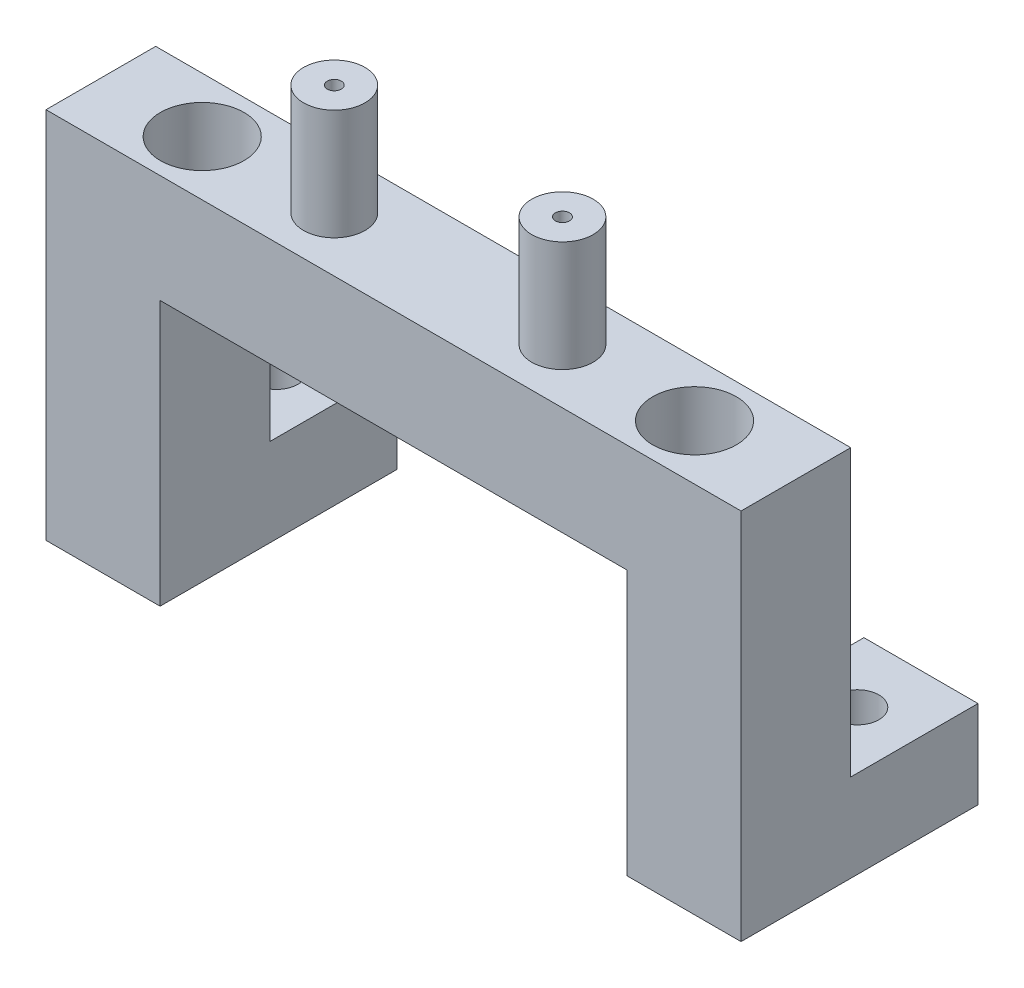
ISO-10303-21;
HEADER;
FILE_DESCRIPTION(('STEP AP214'),'2;1');
FILE_NAME('part.step','',(''),(''),'','','');
FILE_SCHEMA(('AUTOMOTIVE_DESIGN { 1 0 10303 214 1 1 1 1 }'));
ENDSEC;
DATA;
#1=APPLICATION_CONTEXT('core data for automotive mechanical design processes');
#2=APPLICATION_PROTOCOL_DEFINITION('international standard','automotive_design',2000,#1);
#3=PRODUCT_CONTEXT('',#1,'mechanical');
#4=PRODUCT('Part','Part','',(#3));
#5=PRODUCT_RELATED_PRODUCT_CATEGORY('part','',(#4));
#6=PRODUCT_DEFINITION_FORMATION('','',#4);
#7=PRODUCT_DEFINITION_CONTEXT('part definition',#1,'design');
#8=PRODUCT_DEFINITION('design','',#6,#7);
#9=PRODUCT_DEFINITION_SHAPE('','',#8);
#10=(LENGTH_UNIT() NAMED_UNIT(*) SI_UNIT(.MILLI.,.METRE.));
#11=(NAMED_UNIT(*) PLANE_ANGLE_UNIT() SI_UNIT($,.RADIAN.));
#12=(NAMED_UNIT(*) SI_UNIT($,.STERADIAN.) SOLID_ANGLE_UNIT());
#13=UNCERTAINTY_MEASURE_WITH_UNIT(LENGTH_MEASURE(1.E-05),#10,'distance_accuracy_value','');
#14=(GEOMETRIC_REPRESENTATION_CONTEXT(3) GLOBAL_UNCERTAINTY_ASSIGNED_CONTEXT((#13)) GLOBAL_UNIT_ASSIGNED_CONTEXT((#10,
#11,#12)) REPRESENTATION_CONTEXT('',''));
#15=CARTESIAN_POINT('',(0.,0.,0.));
#16=DIRECTION('',(0.,0.,1.));
#17=DIRECTION('',(1.,0.,0.));
#18=AXIS2_PLACEMENT_3D('',#15,#16,#17);
#19=CARTESIAN_POINT('',(0.,0.,0.));
#20=DIRECTION('',(0.,0.,1.));
#21=DIRECTION('',(1.,0.,0.));
#22=AXIS2_PLACEMENT_3D('',#19,#20,#21);
#23=PLANE('',#22);
#24=DIRECTION('',(1.,0.,0.));
#25=VECTOR('',#24,1.);
#26=CARTESIAN_POINT('',(-54.693316182238,-13.3702269343777,0.));
#27=LINE('',#26,#25);
#28=CARTESIAN_POINT('',(-54.693316182238,-13.3702269343777,0.));
#29=VERTEX_POINT('',#28);
#30=CARTESIAN_POINT('',(-41.693316182238,-13.3702269343777,0.));
#31=VERTEX_POINT('',#30);
#32=EDGE_CURVE('E66',#29,#31,#27,.T.);
#33=ORIENTED_EDGE('',*,*,#32,.F.);
#34=DIRECTION('',(0.,1.,0.));
#35=VECTOR('',#34,1.);
#36=CARTESIAN_POINT('',(-54.693316182238,-23.3702269343778,0.));
#37=LINE('',#36,#35);
#38=CARTESIAN_POINT('',(-54.693316182238,19.1297730656223,0.));
#39=VERTEX_POINT('',#38);
#40=EDGE_CURVE('E330',#29,#39,#37,.T.);
#41=ORIENTED_EDGE('',*,*,#40,.T.);
#42=DIRECTION('',(1.,0.,0.));
#43=VECTOR('',#42,1.);
#44=CARTESIAN_POINT('',(-54.693316182238,19.1297730656223,0.));
#45=LINE('',#44,#43);
#46=CARTESIAN_POINT('',(24.506683817762,19.1297730656223,0.));
#47=VERTEX_POINT('',#46);
#48=EDGE_CURVE('E327',#39,#47,#45,.T.);
#49=ORIENTED_EDGE('',*,*,#48,.T.);
#50=DIRECTION('',(0.,1.,0.));
#51=VECTOR('',#50,1.);
#52=CARTESIAN_POINT('',(24.506683817762,-23.3702269343778,0.));
#53=LINE('',#52,#51);
#54=CARTESIAN_POINT('',(24.506683817762,-13.3702269343777,0.));
#55=VERTEX_POINT('',#54);
#56=EDGE_CURVE('E249',#55,#47,#53,.T.);
#57=ORIENTED_EDGE('',*,*,#56,.F.);
#58=DIRECTION('',(-1.,0.,0.));
#59=VECTOR('',#58,1.);
#60=CARTESIAN_POINT('',(24.506683817762,-13.3702269343777,0.));
#61=LINE('',#60,#59);
#62=CARTESIAN_POINT('',(11.506683817762,-13.3702269343777,0.));
#63=VERTEX_POINT('',#62);
#64=EDGE_CURVE('E224',#55,#63,#61,.T.);
#65=ORIENTED_EDGE('',*,*,#64,.T.);
#66=DIRECTION('',(0.,1.,0.));
#67=VECTOR('',#66,1.);
#68=CARTESIAN_POINT('',(11.506683817762,-23.3702269343778,0.));
#69=LINE('',#68,#67);
#70=CARTESIAN_POINT('',(11.506683817762,6.80386050632364,0.));
#71=VERTEX_POINT('',#70);
#72=EDGE_CURVE('E255',#63,#71,#69,.T.);
#73=ORIENTED_EDGE('',*,*,#72,.T.);
#74=DIRECTION('',(1.,0.,0.));
#75=VECTOR('',#74,1.);
#76=CARTESIAN_POINT('',(-41.693316182238,6.80386050632364,0.));
#77=LINE('',#76,#75);
#78=CARTESIAN_POINT('',(-41.693316182238,6.80386050632364,0.));
#79=VERTEX_POINT('',#78);
#80=EDGE_CURVE('E308',#79,#71,#77,.T.);
#81=ORIENTED_EDGE('',*,*,#80,.F.);
#82=DIRECTION('',(0.,1.,0.));
#83=VECTOR('',#82,1.);
#84=CARTESIAN_POINT('',(-41.693316182238,-23.3702269343778,0.));
#85=LINE('',#84,#83);
#86=EDGE_CURVE('E88',#31,#79,#85,.T.);
#87=ORIENTED_EDGE('',*,*,#86,.F.);
#88=EDGE_LOOP('',(#33,#41,#49,#57,#65,#73,#81,#87));
#89=FACE_BOUND('',#88,.T.);
#90=ADVANCED_FACE('F50',(#89),#23,.F.);
#91=CARTESIAN_POINT('',(-41.693316182238,6.80386050632364,12.5));
#92=DIRECTION('',(0.,1.,0.));
#93=DIRECTION('',(0.,0.,1.));
#94=AXIS2_PLACEMENT_3D('',#91,#92,#93);
#95=PLANE('',#94);
#96=CARTESIAN_POINT('',(-28.093316182238,6.80386050632364,6.25000000000001));
#97=DIRECTION('',(0.,1.,0.));
#98=DIRECTION('',(0.,0.,1.));
#99=AXIS2_PLACEMENT_3D('',#96,#97,#98);
#100=CIRCLE('',#99,0.799999999999999);
#101=CARTESIAN_POINT('',(-28.093316182238,6.80386050632364,7.05000000000001));
#102=VERTEX_POINT('',#101);
#103=EDGE_CURVE('E180',#102,#102,#100,.T.);
#104=ORIENTED_EDGE('',*,*,#103,.T.);
#105=EDGE_LOOP('',(#104));
#106=FACE_BOUND('',#105,.T.);
#107=CARTESIAN_POINT('',(-2.09331618223797,6.80386050632364,6.25000000000001));
#108=DIRECTION('',(0.,1.,0.));
#109=DIRECTION('',(0.,0.,1.));
#110=AXIS2_PLACEMENT_3D('',#107,#108,#109);
#111=CIRCLE('',#110,0.8);
#112=CARTESIAN_POINT('',(-2.09331618223797,6.80386050632364,7.05000000000001));
#113=VERTEX_POINT('',#112);
#114=EDGE_CURVE('E188',#113,#113,#111,.T.);
#115=ORIENTED_EDGE('',*,*,#114,.T.);
#116=EDGE_LOOP('',(#115));
#117=FACE_BOUND('',#116,.T.);
#118=ORIENTED_EDGE('',*,*,#80,.T.);
#119=DIRECTION('',(0.,0.,-1.));
#120=VECTOR('',#119,1.);
#121=CARTESIAN_POINT('',(11.506683817762,6.80386050632364,12.5));
#122=LINE('',#121,#120);
#123=CARTESIAN_POINT('',(11.506683817762,6.80386050632364,12.5));
#124=VERTEX_POINT('',#123);
#125=EDGE_CURVE('E263',#124,#71,#122,.T.);
#126=ORIENTED_EDGE('',*,*,#125,.F.);
#127=DIRECTION('',(1.,0.,0.));
#128=VECTOR('',#127,1.);
#129=CARTESIAN_POINT('',(-41.693316182238,6.80386050632364,12.5));
#130=LINE('',#129,#128);
#131=CARTESIAN_POINT('',(-41.693316182238,6.80386050632364,12.5));
#132=VERTEX_POINT('',#131);
#133=EDGE_CURVE('E309',#132,#124,#130,.T.);
#134=ORIENTED_EDGE('',*,*,#133,.F.);
#135=DIRECTION('',(0.,0.,-1.));
#136=VECTOR('',#135,1.);
#137=CARTESIAN_POINT('',(-41.693316182238,6.80386050632364,12.5));
#138=LINE('',#137,#136);
#139=EDGE_CURVE('E324',#132,#79,#138,.T.);
#140=ORIENTED_EDGE('',*,*,#139,.T.);
#141=EDGE_LOOP('',(#118,#126,#134,#140));
#142=FACE_BOUND('',#141,.T.);
#143=ADVANCED_FACE('F52',(#106,#117,#142),#95,.F.);
#144=CARTESIAN_POINT('',(-54.693316182238,19.1297730656223,12.5));
#145=DIRECTION('',(0.,1.,0.));
#146=DIRECTION('',(0.,0.,1.));
#147=AXIS2_PLACEMENT_3D('',#144,#145,#146);
#148=PLANE('',#147);
#149=CARTESIAN_POINT('',(-43.143316182238,19.1297730656223,6.24999999999999));
#150=DIRECTION('',(0.,1.,0.));
#151=DIRECTION('',(0.,0.,1.));
#152=AXIS2_PLACEMENT_3D('',#149,#150,#151);
#153=CIRCLE('',#152,4.7625);
#154=CARTESIAN_POINT('',(-43.143316182238,19.1297730656223,11.0125));
#155=VERTEX_POINT('',#154);
#156=EDGE_CURVE('E163',#155,#155,#153,.T.);
#157=ORIENTED_EDGE('',*,*,#156,.F.);
#158=EDGE_LOOP('',(#157));
#159=FACE_BOUND('',#158,.T.);
#160=CARTESIAN_POINT('',(12.956683817762,19.1297730656223,6.25000000000001));
#161=DIRECTION('',(0.,1.,0.));
#162=DIRECTION('',(0.,0.,1.));
#163=AXIS2_PLACEMENT_3D('',#160,#161,#162);
#164=CIRCLE('',#163,4.7625);
#165=CARTESIAN_POINT('',(12.956683817762,19.1297730656223,11.0125));
#166=VERTEX_POINT('',#165);
#167=EDGE_CURVE('E162',#166,#166,#164,.T.);
#168=ORIENTED_EDGE('',*,*,#167,.F.);
#169=EDGE_LOOP('',(#168));
#170=FACE_BOUND('',#169,.T.);
#171=CARTESIAN_POINT('',(-2.09331618223797,19.1297730656223,6.25000000000001));
#172=DIRECTION('',(0.,1.,0.));
#173=DIRECTION('',(0.,0.,1.));
#174=AXIS2_PLACEMENT_3D('',#171,#172,#173);
#175=CIRCLE('',#174,3.5);
#176=CARTESIAN_POINT('',(-2.09331618223797,19.1297730656223,9.75000000000001));
#177=VERTEX_POINT('',#176);
#178=EDGE_CURVE('E193',#177,#177,#175,.T.);
#179=ORIENTED_EDGE('',*,*,#178,.F.);
#180=EDGE_LOOP('',(#179));
#181=FACE_BOUND('',#180,.T.);
#182=CARTESIAN_POINT('',(-28.093316182238,19.1297730656223,6.25000000000001));
#183=DIRECTION('',(0.,1.,0.));
#184=DIRECTION('',(0.,0.,1.));
#185=AXIS2_PLACEMENT_3D('',#182,#183,#184);
#186=CIRCLE('',#185,3.5);
#187=CARTESIAN_POINT('',(-28.093316182238,19.1297730656223,9.75000000000001));
#188=VERTEX_POINT('',#187);
#189=EDGE_CURVE('E197',#188,#188,#186,.T.);
#190=ORIENTED_EDGE('',*,*,#189,.F.);
#191=EDGE_LOOP('',(#190));
#192=FACE_BOUND('',#191,.T.);
#193=ORIENTED_EDGE('',*,*,#48,.F.);
#194=DIRECTION('',(0.,0.,-1.));
#195=VECTOR('',#194,1.);
#196=CARTESIAN_POINT('',(-54.693316182238,19.1297730656223,12.5));
#197=LINE('',#196,#195);
#198=CARTESIAN_POINT('',(-54.693316182238,19.1297730656223,12.5));
#199=VERTEX_POINT('',#198);
#200=EDGE_CURVE('E12',#199,#39,#197,.T.);
#201=ORIENTED_EDGE('',*,*,#200,.F.);
#202=DIRECTION('',(1.,0.,0.));
#203=VECTOR('',#202,1.);
#204=CARTESIAN_POINT('',(-54.693316182238,19.1297730656223,12.5));
#205=LINE('',#204,#203);
#206=CARTESIAN_POINT('',(24.506683817762,19.1297730656223,12.5));
#207=VERTEX_POINT('',#206);
#208=EDGE_CURVE('E312',#199,#207,#205,.T.);
#209=ORIENTED_EDGE('',*,*,#208,.T.);
#210=DIRECTION('',(0.,0.,-1.));
#211=VECTOR('',#210,1.);
#212=CARTESIAN_POINT('',(24.506683817762,19.1297730656223,12.5));
#213=LINE('',#212,#211);
#214=EDGE_CURVE('E281',#207,#47,#213,.T.);
#215=ORIENTED_EDGE('',*,*,#214,.T.);
#216=EDGE_LOOP('',(#193,#201,#209,#215));
#217=FACE_BOUND('',#216,.T.);
#218=ADVANCED_FACE('F374',(#159,#170,#181,#192,#217),#148,.T.);
#219=CARTESIAN_POINT('',(-54.693316182238,-23.3702269343778,12.5));
#220=DIRECTION('',(-1.,0.,0.));
#221=DIRECTION('',(0.,0.,1.));
#222=AXIS2_PLACEMENT_3D('',#219,#220,#221);
#223=PLANE('',#222);
#224=ORIENTED_EDGE('',*,*,#40,.F.);
#225=DIRECTION('',(0.,0.,1.));
#226=VECTOR('',#225,1.);
#227=CARTESIAN_POINT('',(-54.693316182238,-13.3702269343777,-14.5));
#228=LINE('',#227,#226);
#229=CARTESIAN_POINT('',(-54.693316182238,-13.3702269343777,-14.5));
#230=VERTEX_POINT('',#229);
#231=EDGE_CURVE('E299',#230,#29,#228,.T.);
#232=ORIENTED_EDGE('',*,*,#231,.F.);
#233=DIRECTION('',(0.,1.,0.));
#234=VECTOR('',#233,1.);
#235=CARTESIAN_POINT('',(-54.693316182238,-23.3702269343778,-14.5));
#236=LINE('',#235,#234);
#237=CARTESIAN_POINT('',(-54.693316182238,-23.3702269343778,-14.5));
#238=VERTEX_POINT('',#237);
#239=EDGE_CURVE('E296',#238,#230,#236,.T.);
#240=ORIENTED_EDGE('',*,*,#239,.F.);
#241=DIRECTION('',(0.,0.,-1.));
#242=VECTOR('',#241,1.);
#243=CARTESIAN_POINT('',(-54.693316182238,-23.3702269343778,12.5));
#244=LINE('',#243,#242);
#245=CARTESIAN_POINT('',(-54.693316182238,-23.3702269343778,12.5));
#246=VERTEX_POINT('',#245);
#247=EDGE_CURVE('E59',#246,#238,#244,.T.);
#248=ORIENTED_EDGE('',*,*,#247,.F.);
#249=DIRECTION('',(0.,1.,0.));
#250=VECTOR('',#249,1.);
#251=CARTESIAN_POINT('',(-54.693316182238,-23.3702269343778,12.5));
#252=LINE('',#251,#250);
#253=EDGE_CURVE('E315',#246,#199,#252,.T.);
#254=ORIENTED_EDGE('',*,*,#253,.T.);
#255=ORIENTED_EDGE('',*,*,#200,.T.);
#256=EDGE_LOOP('',(#224,#232,#240,#248,#254,#255));
#257=FACE_BOUND('',#256,.T.);
#258=ADVANCED_FACE('F349',(#257),#223,.T.);
#259=CARTESIAN_POINT('',(-54.693316182238,-23.3702269343778,12.5));
#260=DIRECTION('',(0.,1.,0.));
#261=DIRECTION('',(0.,0.,1.));
#262=AXIS2_PLACEMENT_3D('',#259,#260,#261);
#263=PLANE('',#262);
#264=CARTESIAN_POINT('',(-48.193316182238,-23.3702269343778,-7.25));
#265=DIRECTION('',(0.,1.,0.));
#266=DIRECTION('',(0.,0.,1.));
#267=AXIS2_PLACEMENT_3D('',#264,#265,#266);
#268=CIRCLE('',#267,2.45745);
#269=CARTESIAN_POINT('',(-48.193316182238,-23.3702269343778,-4.79255));
#270=VERTEX_POINT('',#269);
#271=EDGE_CURVE('E212',#270,#270,#268,.T.);
#272=ORIENTED_EDGE('',*,*,#271,.T.);
#273=EDGE_LOOP('',(#272));
#274=FACE_BOUND('',#273,.T.);
#275=ORIENTED_EDGE('',*,*,#247,.T.);
#276=DIRECTION('',(1.,0.,0.));
#277=VECTOR('',#276,1.);
#278=CARTESIAN_POINT('',(-54.693316182238,-23.3702269343778,-14.5));
#279=LINE('',#278,#277);
#280=CARTESIAN_POINT('',(-41.693316182238,-23.3702269343778,-14.5));
#281=VERTEX_POINT('',#280);
#282=EDGE_CURVE('E292',#238,#281,#279,.T.);
#283=ORIENTED_EDGE('',*,*,#282,.T.);
#284=DIRECTION('',(0.,0.,-1.));
#285=VECTOR('',#284,1.);
#286=CARTESIAN_POINT('',(-41.693316182238,-23.3702269343778,12.5));
#287=LINE('',#286,#285);
#288=CARTESIAN_POINT('',(-41.693316182238,-23.3702269343778,12.5));
#289=VERTEX_POINT('',#288);
#290=EDGE_CURVE('E337',#289,#281,#287,.T.);
#291=ORIENTED_EDGE('',*,*,#290,.F.);
#292=DIRECTION('',(1.,0.,0.));
#293=VECTOR('',#292,1.);
#294=CARTESIAN_POINT('',(-54.693316182238,-23.3702269343778,12.5));
#295=LINE('',#294,#293);
#296=EDGE_CURVE('E319',#246,#289,#295,.T.);
#297=ORIENTED_EDGE('',*,*,#296,.F.);
#298=EDGE_LOOP('',(#275,#283,#291,#297));
#299=FACE_BOUND('',#298,.T.);
#300=ADVANCED_FACE('F343',(#274,#299),#263,.F.);
#301=CARTESIAN_POINT('',(-41.693316182238,-23.3702269343778,12.5));
#302=DIRECTION('',(-1.,0.,0.));
#303=DIRECTION('',(0.,0.,1.));
#304=AXIS2_PLACEMENT_3D('',#301,#302,#303);
#305=PLANE('',#304);
#306=ORIENTED_EDGE('',*,*,#290,.T.);
#307=DIRECTION('',(0.,1.,0.));
#308=VECTOR('',#307,1.);
#309=CARTESIAN_POINT('',(-41.693316182238,-23.3702269343778,-14.5));
#310=LINE('',#309,#308);
#311=CARTESIAN_POINT('',(-41.693316182238,-13.3702269343777,-14.5));
#312=VERTEX_POINT('',#311);
#313=EDGE_CURVE('E288',#281,#312,#310,.T.);
#314=ORIENTED_EDGE('',*,*,#313,.T.);
#315=DIRECTION('',(0.,0.,1.));
#316=VECTOR('',#315,1.);
#317=CARTESIAN_POINT('',(-41.693316182238,-13.3702269343777,-14.5));
#318=LINE('',#317,#316);
#319=EDGE_CURVE('E305',#312,#31,#318,.T.);
#320=ORIENTED_EDGE('',*,*,#319,.T.);
#321=ORIENTED_EDGE('',*,*,#86,.T.);
#322=ORIENTED_EDGE('',*,*,#139,.F.);
#323=DIRECTION('',(0.,1.,0.));
#324=VECTOR('',#323,1.);
#325=CARTESIAN_POINT('',(-41.693316182238,-23.3702269343778,12.5));
#326=LINE('',#325,#324);
#327=EDGE_CURVE('E75',#289,#132,#326,.T.);
#328=ORIENTED_EDGE('',*,*,#327,.F.);
#329=EDGE_LOOP('',(#306,#314,#320,#321,#322,#328));
#330=FACE_BOUND('',#329,.T.);
#331=ADVANCED_FACE('F355',(#330),#305,.F.);
#332=CARTESIAN_POINT('',(0.,0.,12.5));
#333=DIRECTION('',(0.,0.,1.));
#334=DIRECTION('',(1.,0.,0.));
#335=AXIS2_PLACEMENT_3D('',#332,#333,#334);
#336=PLANE('',#335);
#337=ORIENTED_EDGE('',*,*,#133,.T.);
#338=DIRECTION('',(0.,1.,0.));
#339=VECTOR('',#338,1.);
#340=CARTESIAN_POINT('',(11.506683817762,-23.3702269343778,12.5));
#341=LINE('',#340,#339);
#342=CARTESIAN_POINT('',(11.506683817762,-23.3702269343778,12.5));
#343=VERTEX_POINT('',#342);
#344=EDGE_CURVE('E259',#343,#124,#341,.T.);
#345=ORIENTED_EDGE('',*,*,#344,.F.);
#346=DIRECTION('',(-1.,0.,0.));
#347=VECTOR('',#346,1.);
#348=CARTESIAN_POINT('',(24.506683817762,-23.3702269343778,12.5));
#349=LINE('',#348,#347);
#350=CARTESIAN_POINT('',(24.506683817762,-23.3702269343778,12.5));
#351=VERTEX_POINT('',#350);
#352=EDGE_CURVE('E254',#351,#343,#349,.T.);
#353=ORIENTED_EDGE('',*,*,#352,.F.);
#354=DIRECTION('',(0.,1.,0.));
#355=VECTOR('',#354,1.);
#356=CARTESIAN_POINT('',(24.506683817762,-23.3702269343778,12.5));
#357=LINE('',#356,#355);
#358=EDGE_CURVE('E250',#351,#207,#357,.T.);
#359=ORIENTED_EDGE('',*,*,#358,.T.);
#360=ORIENTED_EDGE('',*,*,#208,.F.);
#361=ORIENTED_EDGE('',*,*,#253,.F.);
#362=ORIENTED_EDGE('',*,*,#296,.T.);
#363=ORIENTED_EDGE('',*,*,#327,.T.);
#364=EDGE_LOOP('',(#337,#345,#353,#359,#360,#361,#362,#363));
#365=FACE_BOUND('',#364,.T.);
#366=ADVANCED_FACE('F360',(#365),#336,.T.);
#367=CARTESIAN_POINT('',(-54.693316182238,-13.3702269343777,-14.5));
#368=DIRECTION('',(0.,-1.,0.));
#369=DIRECTION('',(0.,0.,-1.));
#370=AXIS2_PLACEMENT_3D('',#367,#368,#369);
#371=PLANE('',#370);
#372=CARTESIAN_POINT('',(-48.193316182238,-13.3702269343777,-7.25));
#373=DIRECTION('',(0.,1.,0.));
#374=DIRECTION('',(0.,0.,1.));
#375=AXIS2_PLACEMENT_3D('',#372,#373,#374);
#376=CIRCLE('',#375,2.45745);
#377=CARTESIAN_POINT('',(-48.193316182238,-13.3702269343777,-4.79255));
#378=VERTEX_POINT('',#377);
#379=EDGE_CURVE('E205',#378,#378,#376,.T.);
#380=ORIENTED_EDGE('',*,*,#379,.F.);
#381=EDGE_LOOP('',(#380));
#382=FACE_BOUND('',#381,.T.);
#383=ORIENTED_EDGE('',*,*,#32,.T.);
#384=ORIENTED_EDGE('',*,*,#319,.F.);
#385=DIRECTION('',(1.,0.,0.));
#386=VECTOR('',#385,1.);
#387=CARTESIAN_POINT('',(-54.693316182238,-13.3702269343777,-14.5));
#388=LINE('',#387,#386);
#389=EDGE_CURVE('E285',#230,#312,#388,.T.);
#390=ORIENTED_EDGE('',*,*,#389,.F.);
#391=ORIENTED_EDGE('',*,*,#231,.T.);
#392=EDGE_LOOP('',(#383,#384,#390,#391));
#393=FACE_BOUND('',#392,.T.);
#394=ADVANCED_FACE('F377',(#382,#393),#371,.F.);
#395=CARTESIAN_POINT('',(0.,0.,-14.5));
#396=DIRECTION('',(0.,0.,1.));
#397=DIRECTION('',(1.,0.,0.));
#398=AXIS2_PLACEMENT_3D('',#395,#396,#397);
#399=PLANE('',#398);
#400=ORIENTED_EDGE('',*,*,#389,.T.);
#401=ORIENTED_EDGE('',*,*,#313,.F.);
#402=ORIENTED_EDGE('',*,*,#282,.F.);
#403=ORIENTED_EDGE('',*,*,#239,.T.);
#404=EDGE_LOOP('',(#400,#401,#402,#403));
#405=FACE_BOUND('',#404,.T.);
#406=ADVANCED_FACE('F353',(#405),#399,.F.);
#407=CARTESIAN_POINT('',(24.506683817762,-23.3702269343778,12.5));
#408=DIRECTION('',(1.,0.,0.));
#409=DIRECTION('',(0.,0.,1.));
#410=AXIS2_PLACEMENT_3D('',#407,#408,#409);
#411=PLANE('',#410);
#412=ORIENTED_EDGE('',*,*,#56,.T.);
#413=ORIENTED_EDGE('',*,*,#214,.F.);
#414=ORIENTED_EDGE('',*,*,#358,.F.);
#415=DIRECTION('',(0.,0.,-1.));
#416=VECTOR('',#415,1.);
#417=CARTESIAN_POINT('',(24.506683817762,-23.3702269343778,12.5));
#418=LINE('',#417,#416);
#419=CARTESIAN_POINT('',(24.506683817762,-23.3702269343778,-14.5));
#420=VERTEX_POINT('',#419);
#421=EDGE_CURVE('E277',#351,#420,#418,.T.);
#422=ORIENTED_EDGE('',*,*,#421,.T.);
#423=DIRECTION('',(0.,1.,0.));
#424=VECTOR('',#423,1.);
#425=CARTESIAN_POINT('',(24.506683817762,-23.3702269343778,-14.5));
#426=LINE('',#425,#424);
#427=CARTESIAN_POINT('',(24.506683817762,-13.3702269343777,-14.5));
#428=VERTEX_POINT('',#427);
#429=EDGE_CURVE('E236',#420,#428,#426,.T.);
#430=ORIENTED_EDGE('',*,*,#429,.T.);
#431=DIRECTION('',(0.,0.,1.));
#432=VECTOR('',#431,1.);
#433=CARTESIAN_POINT('',(24.506683817762,-13.3702269343777,-14.5));
#434=LINE('',#433,#432);
#435=EDGE_CURVE('E240',#428,#55,#434,.T.);
#436=ORIENTED_EDGE('',*,*,#435,.T.);
#437=EDGE_LOOP('',(#412,#413,#414,#422,#430,#436));
#438=FACE_BOUND('',#437,.T.);
#439=ADVANCED_FACE('F372',(#438),#411,.T.);
#440=CARTESIAN_POINT('',(24.506683817762,-23.3702269343778,12.5));
#441=DIRECTION('',(0.,1.,0.));
#442=DIRECTION('',(0.,0.,1.));
#443=AXIS2_PLACEMENT_3D('',#440,#441,#442);
#444=PLANE('',#443);
#445=CARTESIAN_POINT('',(18.006683817762,-23.3702269343778,-7.25));
#446=DIRECTION('',(0.,1.,0.));
#447=DIRECTION('',(0.,0.,1.));
#448=AXIS2_PLACEMENT_3D('',#445,#446,#447);
#449=CIRCLE('',#448,2.45745);
#450=CARTESIAN_POINT('',(18.006683817762,-23.3702269343778,-4.79255));
#451=VERTEX_POINT('',#450);
#452=EDGE_CURVE('E220',#451,#451,#449,.T.);
#453=ORIENTED_EDGE('',*,*,#452,.T.);
#454=EDGE_LOOP('',(#453));
#455=FACE_BOUND('',#454,.T.);
#456=ORIENTED_EDGE('',*,*,#421,.F.);
#457=ORIENTED_EDGE('',*,*,#352,.T.);
#458=DIRECTION('',(0.,0.,-1.));
#459=VECTOR('',#458,1.);
#460=CARTESIAN_POINT('',(11.506683817762,-23.3702269343778,12.5));
#461=LINE('',#460,#459);
#462=CARTESIAN_POINT('',(11.506683817762,-23.3702269343778,-14.5));
#463=VERTEX_POINT('',#462);
#464=EDGE_CURVE('E273',#343,#463,#461,.T.);
#465=ORIENTED_EDGE('',*,*,#464,.T.);
#466=DIRECTION('',(-1.,0.,0.));
#467=VECTOR('',#466,1.);
#468=CARTESIAN_POINT('',(24.506683817762,-23.3702269343778,-14.5));
#469=LINE('',#468,#467);
#470=EDGE_CURVE('E232',#420,#463,#469,.T.);
#471=ORIENTED_EDGE('',*,*,#470,.F.);
#472=EDGE_LOOP('',(#456,#457,#465,#471));
#473=FACE_BOUND('',#472,.T.);
#474=ADVANCED_FACE('F368',(#455,#473),#444,.F.);
#475=CARTESIAN_POINT('',(11.506683817762,-23.3702269343778,12.5));
#476=DIRECTION('',(1.,0.,0.));
#477=DIRECTION('',(0.,0.,1.));
#478=AXIS2_PLACEMENT_3D('',#475,#476,#477);
#479=PLANE('',#478);
#480=ORIENTED_EDGE('',*,*,#464,.F.);
#481=ORIENTED_EDGE('',*,*,#344,.T.);
#482=ORIENTED_EDGE('',*,*,#125,.T.);
#483=ORIENTED_EDGE('',*,*,#72,.F.);
#484=DIRECTION('',(0.,0.,1.));
#485=VECTOR('',#484,1.);
#486=CARTESIAN_POINT('',(11.506683817762,-13.3702269343777,-14.5));
#487=LINE('',#486,#485);
#488=CARTESIAN_POINT('',(11.506683817762,-13.3702269343777,-14.5));
#489=VERTEX_POINT('',#488);
#490=EDGE_CURVE('E246',#489,#63,#487,.T.);
#491=ORIENTED_EDGE('',*,*,#490,.F.);
#492=DIRECTION('',(0.,1.,0.));
#493=VECTOR('',#492,1.);
#494=CARTESIAN_POINT('',(11.506683817762,-23.3702269343778,-14.5));
#495=LINE('',#494,#493);
#496=EDGE_CURVE('E228',#463,#489,#495,.T.);
#497=ORIENTED_EDGE('',*,*,#496,.F.);
#498=EDGE_LOOP('',(#480,#481,#482,#483,#491,#497));
#499=FACE_BOUND('',#498,.T.);
#500=ADVANCED_FACE('F363',(#499),#479,.F.);
#501=CARTESIAN_POINT('',(24.506683817762,-13.3702269343777,-14.5));
#502=DIRECTION('',(0.,-1.,0.));
#503=DIRECTION('',(0.,0.,-1.));
#504=AXIS2_PLACEMENT_3D('',#501,#502,#503);
#505=PLANE('',#504);
#506=CARTESIAN_POINT('',(18.006683817762,-13.3702269343777,-7.25));
#507=DIRECTION('',(0.,1.,0.));
#508=DIRECTION('',(0.,0.,1.));
#509=AXIS2_PLACEMENT_3D('',#506,#507,#508);
#510=CIRCLE('',#509,2.45745);
#511=CARTESIAN_POINT('',(18.006683817762,-13.3702269343777,-4.79255));
#512=VERTEX_POINT('',#511);
#513=EDGE_CURVE('E216',#512,#512,#510,.T.);
#514=ORIENTED_EDGE('',*,*,#513,.F.);
#515=EDGE_LOOP('',(#514));
#516=FACE_BOUND('',#515,.T.);
#517=ORIENTED_EDGE('',*,*,#64,.F.);
#518=ORIENTED_EDGE('',*,*,#435,.F.);
#519=DIRECTION('',(-1.,0.,0.));
#520=VECTOR('',#519,1.);
#521=CARTESIAN_POINT('',(24.506683817762,-13.3702269343777,-14.5));
#522=LINE('',#521,#520);
#523=EDGE_CURVE('E225',#428,#489,#522,.T.);
#524=ORIENTED_EDGE('',*,*,#523,.T.);
#525=ORIENTED_EDGE('',*,*,#490,.T.);
#526=EDGE_LOOP('',(#517,#518,#524,#525));
#527=FACE_BOUND('',#526,.T.);
#528=ADVANCED_FACE('F438',(#516,#527),#505,.F.);
#529=CARTESIAN_POINT('',(-30.1866323644759,0.,-14.5));
#530=DIRECTION('',(0.,0.,1.));
#531=DIRECTION('',(-1.,0.,0.));
#532=AXIS2_PLACEMENT_3D('',#529,#530,#531);
#533=PLANE('',#532);
#534=ORIENTED_EDGE('',*,*,#523,.F.);
#535=ORIENTED_EDGE('',*,*,#429,.F.);
#536=ORIENTED_EDGE('',*,*,#470,.T.);
#537=ORIENTED_EDGE('',*,*,#496,.T.);
#538=EDGE_LOOP('',(#534,#535,#536,#537));
#539=FACE_BOUND('',#538,.T.);
#540=ADVANCED_FACE('F434',(#539),#533,.F.);
#541=CARTESIAN_POINT('',(18.006683817762,-13.3702269343777,-7.25));
#542=DIRECTION('',(0.,1.,0.));
#543=DIRECTION('',(0.,0.,1.));
#544=AXIS2_PLACEMENT_3D('',#541,#542,#543);
#545=CYLINDRICAL_SURFACE('',#544,2.45745);
#546=ORIENTED_EDGE('',*,*,#452,.F.);
#547=EDGE_LOOP('',(#546));
#548=FACE_BOUND('',#547,.T.);
#549=ORIENTED_EDGE('',*,*,#513,.T.);
#550=EDGE_LOOP('',(#549));
#551=FACE_BOUND('',#550,.T.);
#552=ADVANCED_FACE('F426',(#548,#551),#545,.F.);
#553=CARTESIAN_POINT('',(-48.193316182238,-13.3702269343777,-7.25));
#554=DIRECTION('',(0.,1.,0.));
#555=DIRECTION('',(0.,0.,1.));
#556=AXIS2_PLACEMENT_3D('',#553,#554,#555);
#557=CYLINDRICAL_SURFACE('',#556,2.45745);
#558=ORIENTED_EDGE('',*,*,#271,.F.);
#559=EDGE_LOOP('',(#558));
#560=FACE_BOUND('',#559,.T.);
#561=ORIENTED_EDGE('',*,*,#379,.T.);
#562=EDGE_LOOP('',(#561));
#563=FACE_BOUND('',#562,.T.);
#564=ADVANCED_FACE('F416',(#560,#563),#557,.F.);
#565=CARTESIAN_POINT('',(-28.093316182238,31.7297730656223,6.25000000000001));
#566=DIRECTION('',(0.,-1.,0.));
#567=DIRECTION('',(0.,0.,-1.));
#568=AXIS2_PLACEMENT_3D('',#565,#566,#567);
#569=CYLINDRICAL_SURFACE('',#568,3.5);
#570=CARTESIAN_POINT('',(-28.093316182238,31.7297730656223,6.25000000000001));
#571=DIRECTION('',(0.,1.,0.));
#572=DIRECTION('',(0.,0.,1.));
#573=AXIS2_PLACEMENT_3D('',#570,#571,#572);
#574=CIRCLE('',#573,3.5);
#575=CARTESIAN_POINT('',(-28.093316182238,31.7297730656223,9.75000000000001));
#576=VERTEX_POINT('',#575);
#577=EDGE_CURVE('E201',#576,#576,#574,.T.);
#578=ORIENTED_EDGE('',*,*,#577,.F.);
#579=EDGE_LOOP('',(#578));
#580=FACE_BOUND('',#579,.T.);
#581=ORIENTED_EDGE('',*,*,#189,.T.);
#582=EDGE_LOOP('',(#581));
#583=FACE_BOUND('',#582,.T.);
#584=ADVANCED_FACE('F413',(#580,#583),#569,.T.);
#585=CARTESIAN_POINT('',(-28.093316182238,31.7297730656223,6.25000000000001));
#586=DIRECTION('',(0.,1.,0.));
#587=DIRECTION('',(0.,0.,1.));
#588=AXIS2_PLACEMENT_3D('',#585,#586,#587);
#589=PLANE('',#588);
#590=CARTESIAN_POINT('',(-28.093316182238,31.7297730656223,6.25000000000001));
#591=DIRECTION('',(0.,1.,0.));
#592=DIRECTION('',(0.,0.,1.));
#593=AXIS2_PLACEMENT_3D('',#590,#591,#592);
#594=CIRCLE('',#593,0.799999999999999);
#595=CARTESIAN_POINT('',(-28.093316182238,31.7297730656223,7.05000000000001));
#596=VERTEX_POINT('',#595);
#597=EDGE_CURVE('E176',#596,#596,#594,.T.);
#598=ORIENTED_EDGE('',*,*,#597,.F.);
#599=EDGE_LOOP('',(#598));
#600=FACE_BOUND('',#599,.T.);
#601=ORIENTED_EDGE('',*,*,#577,.T.);
#602=EDGE_LOOP('',(#601));
#603=FACE_BOUND('',#602,.T.);
#604=ADVANCED_FACE('F415',(#600,#603),#589,.T.);
#605=CARTESIAN_POINT('',(-2.09331618223797,31.7297730656223,6.25000000000001));
#606=DIRECTION('',(0.,-1.,0.));
#607=DIRECTION('',(0.,0.,-1.));
#608=AXIS2_PLACEMENT_3D('',#605,#606,#607);
#609=CYLINDRICAL_SURFACE('',#608,3.5);
#610=ORIENTED_EDGE('',*,*,#178,.T.);
#611=EDGE_LOOP('',(#610));
#612=FACE_BOUND('',#611,.T.);
#613=CARTESIAN_POINT('',(-2.09331618223797,31.7297730656223,6.25000000000001));
#614=DIRECTION('',(0.,1.,0.));
#615=DIRECTION('',(0.,0.,1.));
#616=AXIS2_PLACEMENT_3D('',#613,#614,#615);
#617=CIRCLE('',#616,3.5);
#618=CARTESIAN_POINT('',(-2.09331618223797,31.7297730656223,9.75000000000001));
#619=VERTEX_POINT('',#618);
#620=EDGE_CURVE('E192',#619,#619,#617,.T.);
#621=ORIENTED_EDGE('',*,*,#620,.F.);
#622=EDGE_LOOP('',(#621));
#623=FACE_BOUND('',#622,.T.);
#624=ADVANCED_FACE('F423',(#612,#623),#609,.T.);
#625=CARTESIAN_POINT('',(0.,31.7297730656223,0.));
#626=DIRECTION('',(0.,1.,0.));
#627=DIRECTION('',(0.,0.,1.));
#628=AXIS2_PLACEMENT_3D('',#625,#626,#627);
#629=PLANE('',#628);
#630=CARTESIAN_POINT('',(-2.09331618223797,31.7297730656223,6.25000000000001));
#631=DIRECTION('',(0.,1.,0.));
#632=DIRECTION('',(0.,0.,1.));
#633=AXIS2_PLACEMENT_3D('',#630,#631,#632);
#634=CIRCLE('',#633,0.8);
#635=CARTESIAN_POINT('',(-2.09331618223797,31.7297730656223,7.05000000000001));
#636=VERTEX_POINT('',#635);
#637=EDGE_CURVE('E184',#636,#636,#634,.T.);
#638=ORIENTED_EDGE('',*,*,#637,.F.);
#639=EDGE_LOOP('',(#638));
#640=FACE_BOUND('',#639,.T.);
#641=ORIENTED_EDGE('',*,*,#620,.T.);
#642=EDGE_LOOP('',(#641));
#643=FACE_BOUND('',#642,.T.);
#644=ADVANCED_FACE('F493',(#640,#643),#629,.T.);
#645=CARTESIAN_POINT('',(-2.09331618223797,1.72977306562225,6.25000000000001));
#646=DIRECTION('',(0.,1.,0.));
#647=DIRECTION('',(0.,0.,1.));
#648=AXIS2_PLACEMENT_3D('',#645,#646,#647);
#649=CYLINDRICAL_SURFACE('',#648,0.8);
#650=ORIENTED_EDGE('',*,*,#637,.T.);
#651=EDGE_LOOP('',(#650));
#652=FACE_BOUND('',#651,.T.);
#653=ORIENTED_EDGE('',*,*,#114,.F.);
#654=EDGE_LOOP('',(#653));
#655=FACE_BOUND('',#654,.T.);
#656=ADVANCED_FACE('F505',(#652,#655),#649,.F.);
#657=CARTESIAN_POINT('',(-28.093316182238,1.72977306562225,6.25000000000001));
#658=DIRECTION('',(0.,1.,0.));
#659=DIRECTION('',(0.,0.,1.));
#660=AXIS2_PLACEMENT_3D('',#657,#658,#659);
#661=CYLINDRICAL_SURFACE('',#660,0.799999999999999);
#662=ORIENTED_EDGE('',*,*,#597,.T.);
#663=EDGE_LOOP('',(#662));
#664=FACE_BOUND('',#663,.T.);
#665=ORIENTED_EDGE('',*,*,#103,.F.);
#666=EDGE_LOOP('',(#665));
#667=FACE_BOUND('',#666,.T.);
#668=ADVANCED_FACE('F514',(#664,#667),#661,.F.);
#669=CARTESIAN_POINT('',(12.956683817762,9.12977306562225,6.25000000000001));
#670=DIRECTION('',(0.,1.,0.));
#671=DIRECTION('',(0.,0.,1.));
#672=AXIS2_PLACEMENT_3D('',#669,#670,#671);
#673=CONICAL_SURFACE('',#672,4.7625,1.02974425867665);
#674=CARTESIAN_POINT('',(12.956683817762,6.26817436750349,6.25000000000001));
#675=VERTEX_POINT('',#674);
#676=VERTEX_LOOP('',#675);
#677=FACE_BOUND('',#676,.T.);
#678=CARTESIAN_POINT('',(12.956683817762,9.12977306562225,6.25000000000001));
#679=DIRECTION('',(0.,1.,0.));
#680=DIRECTION('',(0.,0.,1.));
#681=AXIS2_PLACEMENT_3D('',#678,#679,#680);
#682=CIRCLE('',#681,4.7625);
#683=CARTESIAN_POINT('',(12.956683817762,9.12977306562225,11.0125));
#684=VERTEX_POINT('',#683);
#685=EDGE_CURVE('E168',#684,#684,#682,.T.);
#686=ORIENTED_EDGE('',*,*,#685,.T.);
#687=EDGE_LOOP('',(#686));
#688=FACE_BOUND('',#687,.T.);
#689=ADVANCED_FACE('F537',(#677,#688),#673,.F.);
#690=CARTESIAN_POINT('',(12.956683817762,19.1297730656223,6.25000000000001));
#691=DIRECTION('',(0.,1.,0.));
#692=DIRECTION('',(0.,0.,1.));
#693=AXIS2_PLACEMENT_3D('',#690,#691,#692);
#694=CYLINDRICAL_SURFACE('',#693,4.7625);
#695=ORIENTED_EDGE('',*,*,#685,.F.);
#696=EDGE_LOOP('',(#695));
#697=FACE_BOUND('',#696,.T.);
#698=ORIENTED_EDGE('',*,*,#167,.T.);
#699=EDGE_LOOP('',(#698));
#700=FACE_BOUND('',#699,.T.);
#701=ADVANCED_FACE('F155',(#697,#700),#694,.F.);
#702=CARTESIAN_POINT('',(-43.143316182238,9.12977306562225,6.24999999999999));
#703=DIRECTION('',(0.,1.,0.));
#704=DIRECTION('',(0.,0.,1.));
#705=AXIS2_PLACEMENT_3D('',#702,#703,#704);
#706=CONICAL_SURFACE('',#705,4.7625,1.02974425867665);
#707=CARTESIAN_POINT('',(-43.143316182238,6.26817436750349,6.24999999999999));
#708=VERTEX_POINT('',#707);
#709=VERTEX_LOOP('',#708);
#710=FACE_BOUND('',#709,.T.);
#711=CARTESIAN_POINT('',(-43.143316182238,9.12977306562225,6.24999999999999));
#712=DIRECTION('',(0.,1.,0.));
#713=DIRECTION('',(0.,0.,1.));
#714=AXIS2_PLACEMENT_3D('',#711,#712,#713);
#715=CIRCLE('',#714,4.7625);
#716=CARTESIAN_POINT('',(-43.143316182238,9.12977306562225,11.0125));
#717=VERTEX_POINT('',#716);
#718=EDGE_CURVE('E159',#717,#717,#715,.T.);
#719=ORIENTED_EDGE('',*,*,#718,.T.);
#720=EDGE_LOOP('',(#719));
#721=FACE_BOUND('',#720,.T.);
#722=ADVANCED_FACE('F151',(#710,#721),#706,.F.);
#723=CARTESIAN_POINT('',(-43.143316182238,19.1297730656223,6.24999999999999));
#724=DIRECTION('',(0.,1.,0.));
#725=DIRECTION('',(0.,0.,1.));
#726=AXIS2_PLACEMENT_3D('',#723,#724,#725);
#727=CYLINDRICAL_SURFACE('',#726,4.7625);
#728=ORIENTED_EDGE('',*,*,#718,.F.);
#729=EDGE_LOOP('',(#728));
#730=FACE_BOUND('',#729,.T.);
#731=ORIENTED_EDGE('',*,*,#156,.T.);
#732=EDGE_LOOP('',(#731));
#733=FACE_BOUND('',#732,.T.);
#734=ADVANCED_FACE('F154',(#730,#733),#727,.F.);
#735=CLOSED_SHELL('',(#90,#143,#218,#258,#300,#331,#366,#394,#406,#439,#474,#500,#528,#540,#552,
#564,#584,#604,#624,#644,#656,#668,#689,#701,#722,#734));
#736=MANIFOLD_SOLID_BREP('B2',#735);
#737=ADVANCED_BREP_SHAPE_REPRESENTATION('',(#18,#736),#14);
#738=SHAPE_DEFINITION_REPRESENTATION(#9,#737);
ENDSEC;
END-ISO-10303-21;
